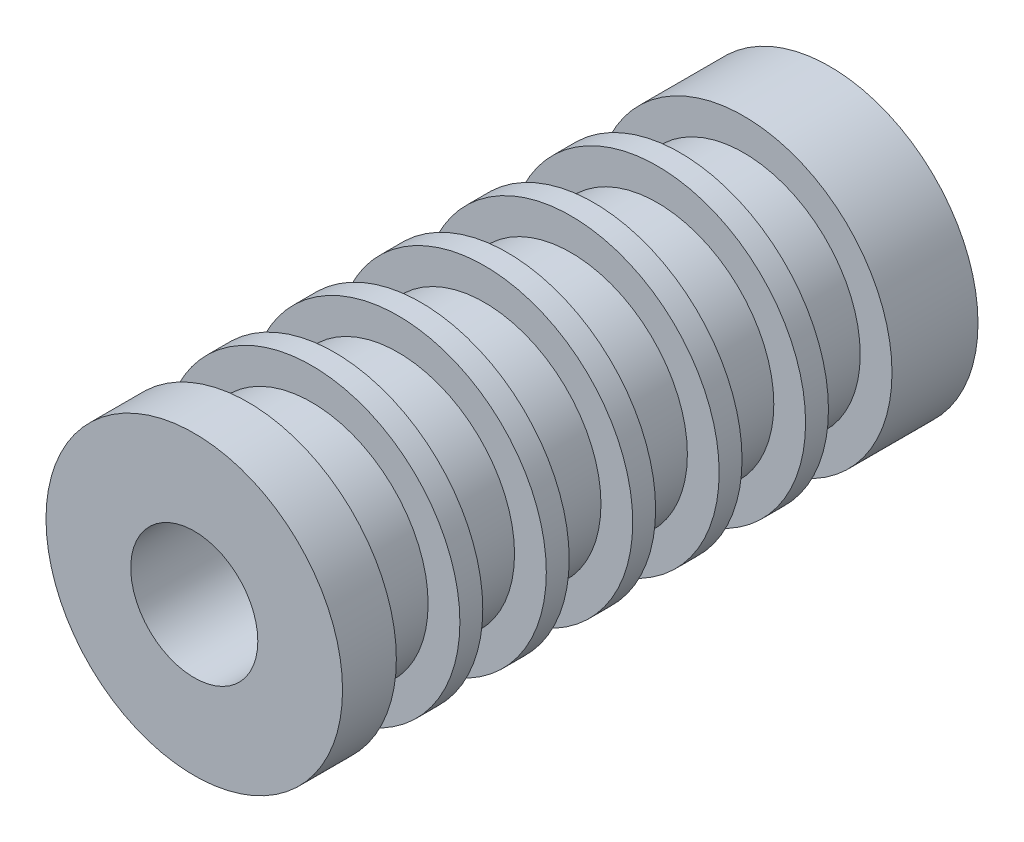
ISO-10303-21;
HEADER;
FILE_DESCRIPTION(('STEP AP214'),'2;1');
FILE_NAME('part.step','',(''),(''),'','','');
FILE_SCHEMA(('AUTOMOTIVE_DESIGN { 1 0 10303 214 1 1 1 1 }'));
ENDSEC;
DATA;
#1=APPLICATION_CONTEXT('core data for automotive mechanical design processes');
#2=APPLICATION_PROTOCOL_DEFINITION('international standard','automotive_design',2000,#1);
#3=PRODUCT_CONTEXT('',#1,'mechanical');
#4=PRODUCT('Part','Part','',(#3));
#5=PRODUCT_RELATED_PRODUCT_CATEGORY('part','',(#4));
#6=PRODUCT_DEFINITION_FORMATION('','',#4);
#7=PRODUCT_DEFINITION_CONTEXT('part definition',#1,'design');
#8=PRODUCT_DEFINITION('design','',#6,#7);
#9=PRODUCT_DEFINITION_SHAPE('','',#8);
#10=(LENGTH_UNIT() NAMED_UNIT(*) SI_UNIT(.MILLI.,.METRE.));
#11=(NAMED_UNIT(*) PLANE_ANGLE_UNIT() SI_UNIT($,.RADIAN.));
#12=(NAMED_UNIT(*) SI_UNIT($,.STERADIAN.) SOLID_ANGLE_UNIT());
#13=UNCERTAINTY_MEASURE_WITH_UNIT(LENGTH_MEASURE(1.E-05),#10,'distance_accuracy_value','');
#14=(GEOMETRIC_REPRESENTATION_CONTEXT(3) GLOBAL_UNCERTAINTY_ASSIGNED_CONTEXT((#13)) GLOBAL_UNIT_ASSIGNED_CONTEXT((#10,
#11,#12)) REPRESENTATION_CONTEXT('',''));
#15=CARTESIAN_POINT('',(0.,0.,0.));
#16=DIRECTION('',(0.,0.,1.));
#17=DIRECTION('',(1.,0.,0.));
#18=AXIS2_PLACEMENT_3D('',#15,#16,#17);
#19=CARTESIAN_POINT('',(0.,0.,25.4));
#20=DIRECTION('',(0.,0.,-1.));
#21=DIRECTION('',(-1.,0.,0.));
#22=AXIS2_PLACEMENT_3D('',#19,#20,#21);
#23=CYLINDRICAL_SURFACE('',#22,11.1125);
#24=CARTESIAN_POINT('',(0.,0.,22.225));
#25=DIRECTION('',(0.,0.,1.));
#26=DIRECTION('',(1.,0.,0.));
#27=AXIS2_PLACEMENT_3D('',#24,#25,#26);
#28=CIRCLE('',#27,11.1125);
#29=CARTESIAN_POINT('',(11.1125,0.,22.225));
#30=VERTEX_POINT('',#29);
#31=EDGE_CURVE('E39',#30,#30,#28,.T.);
#32=ORIENTED_EDGE('',*,*,#31,.F.);
#33=EDGE_LOOP('',(#32));
#34=FACE_BOUND('',#33,.T.);
#35=CARTESIAN_POINT('',(0.,0.,18.19275));
#36=DIRECTION('',(0.,0.,-1.));
#37=DIRECTION('',(-1.,0.,0.));
#38=AXIS2_PLACEMENT_3D('',#35,#36,#37);
#39=CIRCLE('',#38,11.1125);
#40=CARTESIAN_POINT('',(-11.1125,0.,18.19275));
#41=VERTEX_POINT('',#40);
#42=EDGE_CURVE('E68',#41,#41,#39,.T.);
#43=ORIENTED_EDGE('',*,*,#42,.F.);
#44=EDGE_LOOP('',(#43));
#45=FACE_BOUND('',#44,.T.);
#46=ADVANCED_FACE('F32',(#34,#45),#23,.T.);
#47=CARTESIAN_POINT('',(0.,0.,-12.47775));
#48=DIRECTION('',(0.,0.,-1.));
#49=DIRECTION('',(-1.,0.,0.));
#50=AXIS2_PLACEMENT_3D('',#47,#48,#49);
#51=CIRCLE('',#50,11.1125);
#52=CARTESIAN_POINT('',(-11.1125,0.,-12.47775));
#53=VERTEX_POINT('',#52);
#54=EDGE_CURVE('E114',#53,#53,#51,.T.);
#55=ORIENTED_EDGE('',*,*,#54,.T.);
#56=EDGE_LOOP('',(#55));
#57=FACE_BOUND('',#56,.T.);
#58=CARTESIAN_POINT('',(0.,0.,-14.19225));
#59=DIRECTION('',(0.,0.,-1.));
#60=DIRECTION('',(-1.,0.,0.));
#61=AXIS2_PLACEMENT_3D('',#58,#59,#60);
#62=CIRCLE('',#61,11.1125);
#63=CARTESIAN_POINT('',(-11.1125,0.,-14.19225));
#64=VERTEX_POINT('',#63);
#65=EDGE_CURVE('E51',#64,#64,#62,.T.);
#66=ORIENTED_EDGE('',*,*,#65,.F.);
#67=EDGE_LOOP('',(#66));
#68=FACE_BOUND('',#67,.T.);
#69=ADVANCED_FACE('F158',(#57,#68),#23,.T.);
#70=CARTESIAN_POINT('',(0.,0.,-18.95475));
#71=DIRECTION('',(0.,0.,-1.));
#72=DIRECTION('',(-1.,0.,0.));
#73=AXIS2_PLACEMENT_3D('',#70,#71,#72);
#74=CIRCLE('',#73,11.1125);
#75=CARTESIAN_POINT('',(-11.1125,0.,-18.95475));
#76=VERTEX_POINT('',#75);
#77=EDGE_CURVE('E53',#76,#76,#74,.T.);
#78=ORIENTED_EDGE('',*,*,#77,.T.);
#79=EDGE_LOOP('',(#78));
#80=FACE_BOUND('',#79,.T.);
#81=CARTESIAN_POINT('',(0.,0.,-25.4));
#82=DIRECTION('',(0.,0.,1.));
#83=DIRECTION('',(1.,0.,0.));
#84=AXIS2_PLACEMENT_3D('',#81,#82,#83);
#85=CIRCLE('',#84,11.1125);
#86=CARTESIAN_POINT('',(11.1125,0.,-25.4));
#87=VERTEX_POINT('',#86);
#88=EDGE_CURVE('E10',#87,#87,#85,.T.);
#89=ORIENTED_EDGE('',*,*,#88,.T.);
#90=EDGE_LOOP('',(#89));
#91=FACE_BOUND('',#90,.T.);
#92=ADVANCED_FACE('F34',(#80,#91),#23,.T.);
#93=CARTESIAN_POINT('',(0.,0.,-25.4));
#94=DIRECTION('',(0.,0.,1.));
#95=DIRECTION('',(1.,0.,0.));
#96=AXIS2_PLACEMENT_3D('',#93,#94,#95);
#97=PLANE('',#96);
#98=CARTESIAN_POINT('',(0.,0.,-25.4));
#99=DIRECTION('',(0.,0.,1.));
#100=DIRECTION('',(1.,0.,0.));
#101=AXIS2_PLACEMENT_3D('',#98,#99,#100);
#102=CIRCLE('',#101,4.7625);
#103=CARTESIAN_POINT('',(4.7625,0.,-25.4));
#104=VERTEX_POINT('',#103);
#105=EDGE_CURVE('E43',#104,#104,#102,.T.);
#106=ORIENTED_EDGE('',*,*,#105,.T.);
#107=EDGE_LOOP('',(#106));
#108=FACE_BOUND('',#107,.T.);
#109=ORIENTED_EDGE('',*,*,#88,.F.);
#110=EDGE_LOOP('',(#109));
#111=FACE_BOUND('',#110,.T.);
#112=ADVANCED_FACE('F157',(#108,#111),#97,.F.);
#113=CARTESIAN_POINT('',(0.,0.,22.225));
#114=DIRECTION('',(0.,0.,1.));
#115=DIRECTION('',(1.,0.,0.));
#116=AXIS2_PLACEMENT_3D('',#113,#114,#115);
#117=PLANE('',#116);
#118=CARTESIAN_POINT('',(0.,0.,22.225));
#119=DIRECTION('',(0.,0.,1.));
#120=DIRECTION('',(1.,0.,0.));
#121=AXIS2_PLACEMENT_3D('',#118,#119,#120);
#122=CIRCLE('',#121,4.7625);
#123=CARTESIAN_POINT('',(4.7625,0.,22.225));
#124=VERTEX_POINT('',#123);
#125=EDGE_CURVE('E47',#124,#124,#122,.T.);
#126=ORIENTED_EDGE('',*,*,#125,.F.);
#127=EDGE_LOOP('',(#126));
#128=FACE_BOUND('',#127,.T.);
#129=ORIENTED_EDGE('',*,*,#31,.T.);
#130=EDGE_LOOP('',(#129));
#131=FACE_BOUND('',#130,.T.);
#132=ADVANCED_FACE('F234',(#128,#131),#117,.T.);
#133=CARTESIAN_POINT('',(0.,0.,-25.4));
#134=DIRECTION('',(0.,0.,1.));
#135=DIRECTION('',(1.,0.,0.));
#136=AXIS2_PLACEMENT_3D('',#133,#134,#135);
#137=CYLINDRICAL_SURFACE('',#136,4.7625);
#138=ORIENTED_EDGE('',*,*,#105,.F.);
#139=EDGE_LOOP('',(#138));
#140=FACE_BOUND('',#139,.T.);
#141=ORIENTED_EDGE('',*,*,#125,.T.);
#142=EDGE_LOOP('',(#141));
#143=FACE_BOUND('',#142,.T.);
#144=ADVANCED_FACE('F227',(#140,#143),#137,.F.);
#145=CARTESIAN_POINT('',(0.,0.,-14.19225));
#146=DIRECTION('',(0.,0.,-1.));
#147=DIRECTION('',(-1.,0.,0.));
#148=AXIS2_PLACEMENT_3D('',#145,#146,#147);
#149=PLANE('',#148);
#150=CARTESIAN_POINT('',(0.,0.,-14.19225));
#151=DIRECTION('',(0.,0.,-1.));
#152=DIRECTION('',(-1.,0.,0.));
#153=AXIS2_PLACEMENT_3D('',#150,#151,#152);
#154=CIRCLE('',#153,8.73125);
#155=CARTESIAN_POINT('',(-8.73125,0.,-14.19225));
#156=VERTEX_POINT('',#155);
#157=EDGE_CURVE('E56',#156,#156,#154,.T.);
#158=ORIENTED_EDGE('',*,*,#157,.F.);
#159=EDGE_LOOP('',(#158));
#160=FACE_BOUND('',#159,.T.);
#161=ORIENTED_EDGE('',*,*,#65,.T.);
#162=EDGE_LOOP('',(#161));
#163=FACE_BOUND('',#162,.T.);
#164=ADVANCED_FACE('F224',(#160,#163),#149,.T.);
#165=CARTESIAN_POINT('',(0.,0.,-18.95475));
#166=DIRECTION('',(0.,0.,-1.));
#167=DIRECTION('',(-1.,0.,0.));
#168=AXIS2_PLACEMENT_3D('',#165,#166,#167);
#169=PLANE('',#168);
#170=CARTESIAN_POINT('',(0.,0.,-18.95475));
#171=DIRECTION('',(0.,0.,-1.));
#172=DIRECTION('',(-1.,0.,0.));
#173=AXIS2_PLACEMENT_3D('',#170,#171,#172);
#174=CIRCLE('',#173,8.73125);
#175=CARTESIAN_POINT('',(-8.73125,0.,-18.95475));
#176=VERTEX_POINT('',#175);
#177=EDGE_CURVE('E59',#176,#176,#174,.T.);
#178=ORIENTED_EDGE('',*,*,#177,.T.);
#179=EDGE_LOOP('',(#178));
#180=FACE_BOUND('',#179,.T.);
#181=ORIENTED_EDGE('',*,*,#77,.F.);
#182=EDGE_LOOP('',(#181));
#183=FACE_BOUND('',#182,.T.);
#184=ADVANCED_FACE('F222',(#180,#183),#169,.F.);
#185=CARTESIAN_POINT('',(0.,0.,-14.19225));
#186=DIRECTION('',(0.,0.,-1.));
#187=DIRECTION('',(-1.,0.,0.));
#188=AXIS2_PLACEMENT_3D('',#185,#186,#187);
#189=CYLINDRICAL_SURFACE('',#188,8.73125);
#190=ORIENTED_EDGE('',*,*,#157,.T.);
#191=EDGE_LOOP('',(#190));
#192=FACE_BOUND('',#191,.T.);
#193=ORIENTED_EDGE('',*,*,#177,.F.);
#194=EDGE_LOOP('',(#193));
#195=FACE_BOUND('',#194,.T.);
#196=ADVANCED_FACE('F215',(#192,#195),#189,.T.);
#197=CARTESIAN_POINT('',(0.,0.,18.19275));
#198=DIRECTION('',(0.,0.,-1.));
#199=DIRECTION('',(-1.,0.,0.));
#200=AXIS2_PLACEMENT_3D('',#197,#198,#199);
#201=PLANE('',#200);
#202=CARTESIAN_POINT('',(0.,0.,18.19275));
#203=DIRECTION('',(0.,0.,-1.));
#204=DIRECTION('',(-1.,0.,0.));
#205=AXIS2_PLACEMENT_3D('',#202,#203,#204);
#206=CIRCLE('',#205,8.73125);
#207=CARTESIAN_POINT('',(-8.73125,0.,18.19275));
#208=VERTEX_POINT('',#207);
#209=EDGE_CURVE('E69',#208,#208,#206,.T.);
#210=ORIENTED_EDGE('',*,*,#209,.F.);
#211=EDGE_LOOP('',(#210));
#212=FACE_BOUND('',#211,.T.);
#213=ORIENTED_EDGE('',*,*,#42,.T.);
#214=EDGE_LOOP('',(#213));
#215=FACE_BOUND('',#214,.T.);
#216=ADVANCED_FACE('F212',(#212,#215),#201,.T.);
#217=CARTESIAN_POINT('',(0.,0.,13.43025));
#218=DIRECTION('',(0.,0.,-1.));
#219=DIRECTION('',(-1.,0.,0.));
#220=AXIS2_PLACEMENT_3D('',#217,#218,#219);
#221=PLANE('',#220);
#222=CARTESIAN_POINT('',(0.,0.,13.43025));
#223=DIRECTION('',(0.,0.,-1.));
#224=DIRECTION('',(-1.,0.,0.));
#225=AXIS2_PLACEMENT_3D('',#222,#223,#224);
#226=CIRCLE('',#225,8.73125);
#227=CARTESIAN_POINT('',(-8.73125,0.,13.43025));
#228=VERTEX_POINT('',#227);
#229=EDGE_CURVE('E73',#228,#228,#226,.T.);
#230=ORIENTED_EDGE('',*,*,#229,.T.);
#231=EDGE_LOOP('',(#230));
#232=FACE_BOUND('',#231,.T.);
#233=CARTESIAN_POINT('',(0.,0.,13.43025));
#234=DIRECTION('',(0.,0.,-1.));
#235=DIRECTION('',(-1.,0.,0.));
#236=AXIS2_PLACEMENT_3D('',#233,#234,#235);
#237=CIRCLE('',#236,11.1125);
#238=CARTESIAN_POINT('',(-11.1125,0.,13.43025));
#239=VERTEX_POINT('',#238);
#240=EDGE_CURVE('E65',#239,#239,#237,.T.);
#241=ORIENTED_EDGE('',*,*,#240,.F.);
#242=EDGE_LOOP('',(#241));
#243=FACE_BOUND('',#242,.T.);
#244=ADVANCED_FACE('F210',(#232,#243),#221,.F.);
#245=CARTESIAN_POINT('',(0.,0.,18.19275));
#246=DIRECTION('',(0.,0.,-1.));
#247=DIRECTION('',(-1.,0.,0.));
#248=AXIS2_PLACEMENT_3D('',#245,#246,#247);
#249=CYLINDRICAL_SURFACE('',#248,8.73125);
#250=ORIENTED_EDGE('',*,*,#209,.T.);
#251=EDGE_LOOP('',(#250));
#252=FACE_BOUND('',#251,.T.);
#253=ORIENTED_EDGE('',*,*,#229,.F.);
#254=EDGE_LOOP('',(#253));
#255=FACE_BOUND('',#254,.T.);
#256=ADVANCED_FACE('F132',(#252,#255),#249,.T.);
#257=CARTESIAN_POINT('',(0.,0.,-7.71525));
#258=DIRECTION('',(0.,0.,-1.));
#259=DIRECTION('',(-1.,0.,0.));
#260=AXIS2_PLACEMENT_3D('',#257,#258,#259);
#261=PLANE('',#260);
#262=CARTESIAN_POINT('',(0.,0.,-7.71525));
#263=DIRECTION('',(0.,0.,-1.));
#264=DIRECTION('',(-1.,0.,0.));
#265=AXIS2_PLACEMENT_3D('',#262,#263,#264);
#266=CIRCLE('',#265,8.73125);
#267=CARTESIAN_POINT('',(-8.73125,0.,-7.71525));
#268=VERTEX_POINT('',#267);
#269=EDGE_CURVE('E117',#268,#268,#266,.T.);
#270=ORIENTED_EDGE('',*,*,#269,.F.);
#271=EDGE_LOOP('',(#270));
#272=FACE_BOUND('',#271,.T.);
#273=CARTESIAN_POINT('',(0.,0.,-7.71525));
#274=DIRECTION('',(0.,0.,-1.));
#275=DIRECTION('',(-1.,0.,0.));
#276=AXIS2_PLACEMENT_3D('',#273,#274,#275);
#277=CIRCLE('',#276,11.1125);
#278=CARTESIAN_POINT('',(-11.1125,0.,-7.71525));
#279=VERTEX_POINT('',#278);
#280=EDGE_CURVE('E62',#279,#279,#277,.T.);
#281=ORIENTED_EDGE('',*,*,#280,.T.);
#282=EDGE_LOOP('',(#281));
#283=FACE_BOUND('',#282,.T.);
#284=ADVANCED_FACE('F128',(#272,#283),#261,.T.);
#285=CARTESIAN_POINT('',(0.,0.,-12.47775));
#286=DIRECTION('',(0.,0.,-1.));
#287=DIRECTION('',(-1.,0.,0.));
#288=AXIS2_PLACEMENT_3D('',#285,#286,#287);
#289=PLANE('',#288);
#290=CARTESIAN_POINT('',(0.,0.,-12.47775));
#291=DIRECTION('',(0.,0.,-1.));
#292=DIRECTION('',(-1.,0.,0.));
#293=AXIS2_PLACEMENT_3D('',#290,#291,#292);
#294=CIRCLE('',#293,8.73125);
#295=CARTESIAN_POINT('',(-8.73125,0.,-12.47775));
#296=VERTEX_POINT('',#295);
#297=EDGE_CURVE('E109',#296,#296,#294,.T.);
#298=ORIENTED_EDGE('',*,*,#297,.T.);
#299=EDGE_LOOP('',(#298));
#300=FACE_BOUND('',#299,.T.);
#301=ORIENTED_EDGE('',*,*,#54,.F.);
#302=EDGE_LOOP('',(#301));
#303=FACE_BOUND('',#302,.T.);
#304=ADVANCED_FACE('F131',(#300,#303),#289,.F.);
#305=CARTESIAN_POINT('',(0.,0.,-7.71525));
#306=DIRECTION('',(0.,0.,-1.));
#307=DIRECTION('',(-1.,0.,0.));
#308=AXIS2_PLACEMENT_3D('',#305,#306,#307);
#309=CYLINDRICAL_SURFACE('',#308,8.73125);
#310=ORIENTED_EDGE('',*,*,#269,.T.);
#311=EDGE_LOOP('',(#310));
#312=FACE_BOUND('',#311,.T.);
#313=ORIENTED_EDGE('',*,*,#297,.F.);
#314=EDGE_LOOP('',(#313));
#315=FACE_BOUND('',#314,.T.);
#316=ADVANCED_FACE('F125',(#312,#315),#309,.T.);
#317=ORIENTED_EDGE('',*,*,#240,.T.);
#318=EDGE_LOOP('',(#317));
#319=FACE_BOUND('',#318,.T.);
#320=CARTESIAN_POINT('',(0.,0.,11.71575));
#321=DIRECTION('',(0.,0.,-1.));
#322=DIRECTION('',(-1.,0.,0.));
#323=AXIS2_PLACEMENT_3D('',#320,#321,#322);
#324=CIRCLE('',#323,11.1125);
#325=CARTESIAN_POINT('',(-11.1125,0.,11.71575));
#326=VERTEX_POINT('',#325);
#327=EDGE_CURVE('E81',#326,#326,#324,.T.);
#328=ORIENTED_EDGE('',*,*,#327,.F.);
#329=EDGE_LOOP('',(#328));
#330=FACE_BOUND('',#329,.T.);
#331=ADVANCED_FACE('F162',(#319,#330),#23,.T.);
#332=CARTESIAN_POINT('',(0.,0.,11.71575));
#333=DIRECTION('',(0.,0.,-1.));
#334=DIRECTION('',(-1.,0.,0.));
#335=AXIS2_PLACEMENT_3D('',#332,#333,#334);
#336=PLANE('',#335);
#337=CARTESIAN_POINT('',(0.,0.,11.71575));
#338=DIRECTION('',(0.,0.,-1.));
#339=DIRECTION('',(-1.,0.,0.));
#340=AXIS2_PLACEMENT_3D('',#337,#338,#339);
#341=CIRCLE('',#340,8.73125);
#342=CARTESIAN_POINT('',(-8.73125,0.,11.71575));
#343=VERTEX_POINT('',#342);
#344=EDGE_CURVE('E82',#343,#343,#341,.T.);
#345=ORIENTED_EDGE('',*,*,#344,.F.);
#346=EDGE_LOOP('',(#345));
#347=FACE_BOUND('',#346,.T.);
#348=ORIENTED_EDGE('',*,*,#327,.T.);
#349=EDGE_LOOP('',(#348));
#350=FACE_BOUND('',#349,.T.);
#351=ADVANCED_FACE('F169',(#347,#350),#336,.T.);
#352=CARTESIAN_POINT('',(0.,0.,6.95325));
#353=DIRECTION('',(0.,0.,-1.));
#354=DIRECTION('',(-1.,0.,0.));
#355=AXIS2_PLACEMENT_3D('',#352,#353,#354);
#356=PLANE('',#355);
#357=CARTESIAN_POINT('',(0.,0.,6.95325));
#358=DIRECTION('',(0.,0.,-1.));
#359=DIRECTION('',(-1.,0.,0.));
#360=AXIS2_PLACEMENT_3D('',#357,#358,#359);
#361=CIRCLE('',#360,8.73125);
#362=CARTESIAN_POINT('',(-8.73125,0.,6.95325));
#363=VERTEX_POINT('',#362);
#364=EDGE_CURVE('E72',#363,#363,#361,.T.);
#365=ORIENTED_EDGE('',*,*,#364,.T.);
#366=EDGE_LOOP('',(#365));
#367=FACE_BOUND('',#366,.T.);
#368=CARTESIAN_POINT('',(0.,0.,6.95325));
#369=DIRECTION('',(0.,0.,-1.));
#370=DIRECTION('',(-1.,0.,0.));
#371=AXIS2_PLACEMENT_3D('',#368,#369,#370);
#372=CIRCLE('',#371,11.1125);
#373=CARTESIAN_POINT('',(-11.1125,0.,6.95325));
#374=VERTEX_POINT('',#373);
#375=EDGE_CURVE('E78',#374,#374,#372,.T.);
#376=ORIENTED_EDGE('',*,*,#375,.F.);
#377=EDGE_LOOP('',(#376));
#378=FACE_BOUND('',#377,.T.);
#379=ADVANCED_FACE('F149',(#367,#378),#356,.F.);
#380=CARTESIAN_POINT('',(0.,0.,11.71575));
#381=DIRECTION('',(0.,0.,-1.));
#382=DIRECTION('',(-1.,0.,0.));
#383=AXIS2_PLACEMENT_3D('',#380,#381,#382);
#384=CYLINDRICAL_SURFACE('',#383,8.73125);
#385=ORIENTED_EDGE('',*,*,#344,.T.);
#386=EDGE_LOOP('',(#385));
#387=FACE_BOUND('',#386,.T.);
#388=ORIENTED_EDGE('',*,*,#364,.F.);
#389=EDGE_LOOP('',(#388));
#390=FACE_BOUND('',#389,.T.);
#391=ADVANCED_FACE('F139',(#387,#390),#384,.T.);
#392=CARTESIAN_POINT('',(0.,0.,-6.00075));
#393=DIRECTION('',(0.,0.,-1.));
#394=DIRECTION('',(-1.,0.,0.));
#395=AXIS2_PLACEMENT_3D('',#392,#393,#394);
#396=CIRCLE('',#395,11.1125);
#397=CARTESIAN_POINT('',(-11.1125,0.,-6.00075));
#398=VERTEX_POINT('',#397);
#399=EDGE_CURVE('E102',#398,#398,#396,.T.);
#400=ORIENTED_EDGE('',*,*,#399,.T.);
#401=EDGE_LOOP('',(#400));
#402=FACE_BOUND('',#401,.T.);
#403=ORIENTED_EDGE('',*,*,#280,.F.);
#404=EDGE_LOOP('',(#403));
#405=FACE_BOUND('',#404,.T.);
#406=ADVANCED_FACE('F136',(#402,#405),#23,.T.);
#407=CARTESIAN_POINT('',(0.,0.,-1.23825));
#408=DIRECTION('',(0.,0.,-1.));
#409=DIRECTION('',(-1.,0.,0.));
#410=AXIS2_PLACEMENT_3D('',#407,#408,#409);
#411=PLANE('',#410);
#412=CARTESIAN_POINT('',(0.,0.,-1.23825));
#413=DIRECTION('',(0.,0.,-1.));
#414=DIRECTION('',(-1.,0.,0.));
#415=AXIS2_PLACEMENT_3D('',#412,#413,#414);
#416=CIRCLE('',#415,8.73125);
#417=CARTESIAN_POINT('',(-8.73125,0.,-1.23825));
#418=VERTEX_POINT('',#417);
#419=EDGE_CURVE('E106',#418,#418,#416,.T.);
#420=ORIENTED_EDGE('',*,*,#419,.F.);
#421=EDGE_LOOP('',(#420));
#422=FACE_BOUND('',#421,.T.);
#423=CARTESIAN_POINT('',(0.,0.,-1.23825));
#424=DIRECTION('',(0.,0.,-1.));
#425=DIRECTION('',(-1.,0.,0.));
#426=AXIS2_PLACEMENT_3D('',#423,#424,#425);
#427=CIRCLE('',#426,11.1125);
#428=CARTESIAN_POINT('',(-11.1125,0.,-1.23825));
#429=VERTEX_POINT('',#428);
#430=EDGE_CURVE('E105',#429,#429,#427,.T.);
#431=ORIENTED_EDGE('',*,*,#430,.T.);
#432=EDGE_LOOP('',(#431));
#433=FACE_BOUND('',#432,.T.);
#434=ADVANCED_FACE('F138',(#422,#433),#411,.T.);
#435=CARTESIAN_POINT('',(0.,0.,-6.00075));
#436=DIRECTION('',(0.,0.,-1.));
#437=DIRECTION('',(-1.,0.,0.));
#438=AXIS2_PLACEMENT_3D('',#435,#436,#437);
#439=PLANE('',#438);
#440=CARTESIAN_POINT('',(0.,0.,-6.00075));
#441=DIRECTION('',(0.,0.,-1.));
#442=DIRECTION('',(-1.,0.,0.));
#443=AXIS2_PLACEMENT_3D('',#440,#441,#442);
#444=CIRCLE('',#443,8.73125);
#445=CARTESIAN_POINT('',(-8.73125,0.,-6.00075));
#446=VERTEX_POINT('',#445);
#447=EDGE_CURVE('E97',#446,#446,#444,.T.);
#448=ORIENTED_EDGE('',*,*,#447,.T.);
#449=EDGE_LOOP('',(#448));
#450=FACE_BOUND('',#449,.T.);
#451=ORIENTED_EDGE('',*,*,#399,.F.);
#452=EDGE_LOOP('',(#451));
#453=FACE_BOUND('',#452,.T.);
#454=ADVANCED_FACE('F146',(#450,#453),#439,.F.);
#455=CARTESIAN_POINT('',(0.,0.,-1.23825));
#456=DIRECTION('',(0.,0.,-1.));
#457=DIRECTION('',(-1.,0.,0.));
#458=AXIS2_PLACEMENT_3D('',#455,#456,#457);
#459=CYLINDRICAL_SURFACE('',#458,8.73125);
#460=ORIENTED_EDGE('',*,*,#419,.T.);
#461=EDGE_LOOP('',(#460));
#462=FACE_BOUND('',#461,.T.);
#463=ORIENTED_EDGE('',*,*,#447,.F.);
#464=EDGE_LOOP('',(#463));
#465=FACE_BOUND('',#464,.T.);
#466=ADVANCED_FACE('F180',(#462,#465),#459,.T.);
#467=ORIENTED_EDGE('',*,*,#375,.T.);
#468=EDGE_LOOP('',(#467));
#469=FACE_BOUND('',#468,.T.);
#470=CARTESIAN_POINT('',(0.,0.,5.23875));
#471=DIRECTION('',(0.,0.,-1.));
#472=DIRECTION('',(-1.,0.,0.));
#473=AXIS2_PLACEMENT_3D('',#470,#471,#472);
#474=CIRCLE('',#473,11.1125);
#475=CARTESIAN_POINT('',(-11.1125,0.,5.23875));
#476=VERTEX_POINT('',#475);
#477=EDGE_CURVE('E93',#476,#476,#474,.T.);
#478=ORIENTED_EDGE('',*,*,#477,.F.);
#479=EDGE_LOOP('',(#478));
#480=FACE_BOUND('',#479,.T.);
#481=ADVANCED_FACE('F154',(#469,#480),#23,.T.);
#482=CARTESIAN_POINT('',(0.,0.,0.476250000000001));
#483=DIRECTION('',(0.,0.,-1.));
#484=DIRECTION('',(-1.,0.,0.));
#485=AXIS2_PLACEMENT_3D('',#482,#483,#484);
#486=CIRCLE('',#485,11.1125);
#487=CARTESIAN_POINT('',(-11.1125,0.,0.476250000000001));
#488=VERTEX_POINT('',#487);
#489=EDGE_CURVE('E90',#488,#488,#486,.T.);
#490=ORIENTED_EDGE('',*,*,#489,.T.);
#491=EDGE_LOOP('',(#490));
#492=FACE_BOUND('',#491,.T.);
#493=ORIENTED_EDGE('',*,*,#430,.F.);
#494=EDGE_LOOP('',(#493));
#495=FACE_BOUND('',#494,.T.);
#496=ADVANCED_FACE('F141',(#492,#495),#23,.T.);
#497=CARTESIAN_POINT('',(0.,0.,5.23875));
#498=DIRECTION('',(0.,0.,-1.));
#499=DIRECTION('',(-1.,0.,0.));
#500=AXIS2_PLACEMENT_3D('',#497,#498,#499);
#501=PLANE('',#500);
#502=CARTESIAN_POINT('',(0.,0.,5.23875));
#503=DIRECTION('',(0.,0.,-1.));
#504=DIRECTION('',(-1.,0.,0.));
#505=AXIS2_PLACEMENT_3D('',#502,#503,#504);
#506=CIRCLE('',#505,8.73125);
#507=CARTESIAN_POINT('',(-8.73125,0.,5.23875));
#508=VERTEX_POINT('',#507);
#509=EDGE_CURVE('E94',#508,#508,#506,.T.);
#510=ORIENTED_EDGE('',*,*,#509,.F.);
#511=EDGE_LOOP('',(#510));
#512=FACE_BOUND('',#511,.T.);
#513=ORIENTED_EDGE('',*,*,#477,.T.);
#514=EDGE_LOOP('',(#513));
#515=FACE_BOUND('',#514,.T.);
#516=ADVANCED_FACE('F153',(#512,#515),#501,.T.);
#517=CARTESIAN_POINT('',(0.,0.,0.476250000000001));
#518=DIRECTION('',(0.,0.,-1.));
#519=DIRECTION('',(-1.,0.,0.));
#520=AXIS2_PLACEMENT_3D('',#517,#518,#519);
#521=PLANE('',#520);
#522=CARTESIAN_POINT('',(0.,0.,0.476250000000001));
#523=DIRECTION('',(0.,0.,-1.));
#524=DIRECTION('',(-1.,0.,0.));
#525=AXIS2_PLACEMENT_3D('',#522,#523,#524);
#526=CIRCLE('',#525,8.73125);
#527=CARTESIAN_POINT('',(-8.73125,0.,0.476250000000001));
#528=VERTEX_POINT('',#527);
#529=EDGE_CURVE('E85',#528,#528,#526,.T.);
#530=ORIENTED_EDGE('',*,*,#529,.T.);
#531=EDGE_LOOP('',(#530));
#532=FACE_BOUND('',#531,.T.);
#533=ORIENTED_EDGE('',*,*,#489,.F.);
#534=EDGE_LOOP('',(#533));
#535=FACE_BOUND('',#534,.T.);
#536=ADVANCED_FACE('F192',(#532,#535),#521,.F.);
#537=CARTESIAN_POINT('',(0.,0.,5.23875));
#538=DIRECTION('',(0.,0.,-1.));
#539=DIRECTION('',(-1.,0.,0.));
#540=AXIS2_PLACEMENT_3D('',#537,#538,#539);
#541=CYLINDRICAL_SURFACE('',#540,8.73125);
#542=ORIENTED_EDGE('',*,*,#509,.T.);
#543=EDGE_LOOP('',(#542));
#544=FACE_BOUND('',#543,.T.);
#545=ORIENTED_EDGE('',*,*,#529,.F.);
#546=EDGE_LOOP('',(#545));
#547=FACE_BOUND('',#546,.T.);
#548=ADVANCED_FACE('F198',(#544,#547),#541,.T.);
#549=CLOSED_SHELL('',(#46,#69,#92,#112,#132,#144,#164,#184,#196,#216,#244,#256,#284,#304,#316,
#331,#351,#379,#391,#406,#434,#454,#466,#481,#496,#516,#536,#548));
#550=MANIFOLD_SOLID_BREP('B2',#549);
#551=ADVANCED_BREP_SHAPE_REPRESENTATION('',(#18,#550),#14);
#552=SHAPE_DEFINITION_REPRESENTATION(#9,#551);
ENDSEC;
END-ISO-10303-21;
